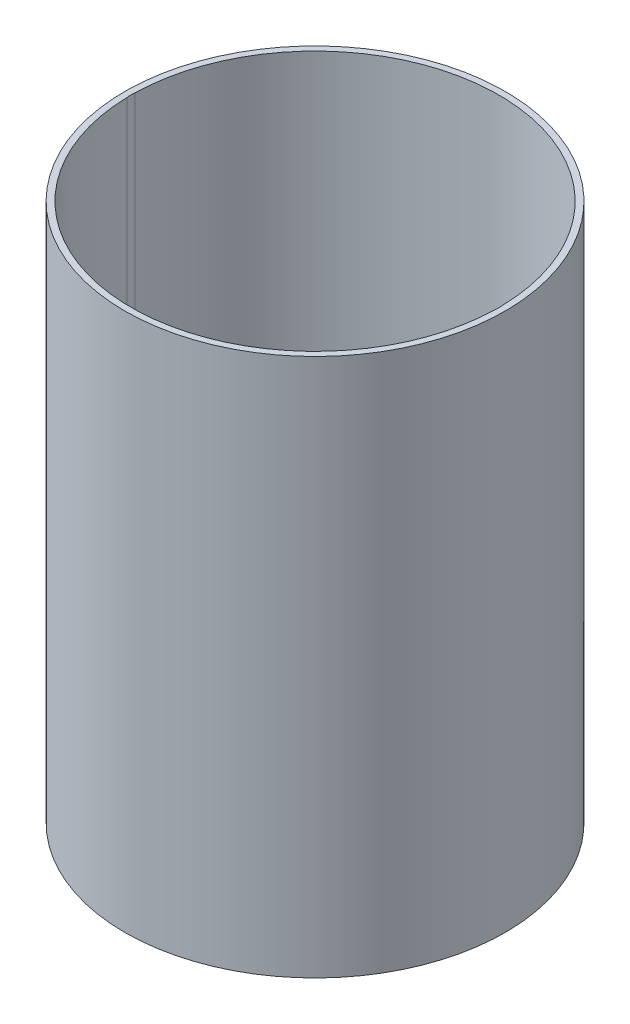
ISO-10303-21;
HEADER;
FILE_DESCRIPTION(('STEP AP214'),'2;1');
FILE_NAME('part.step','',(''),(''),'','','');
FILE_SCHEMA(('AUTOMOTIVE_DESIGN { 1 0 10303 214 1 1 1 1 }'));
ENDSEC;
DATA;
#1=APPLICATION_CONTEXT('core data for automotive mechanical design processes');
#2=APPLICATION_PROTOCOL_DEFINITION('international standard','automotive_design',2000,#1);
#3=PRODUCT_CONTEXT('',#1,'mechanical');
#4=PRODUCT('Part','Part','',(#3));
#5=PRODUCT_RELATED_PRODUCT_CATEGORY('part','',(#4));
#6=PRODUCT_DEFINITION_FORMATION('','',#4);
#7=PRODUCT_DEFINITION_CONTEXT('part definition',#1,'design');
#8=PRODUCT_DEFINITION('design','',#6,#7);
#9=PRODUCT_DEFINITION_SHAPE('','',#8);
#10=(LENGTH_UNIT() NAMED_UNIT(*) SI_UNIT(.MILLI.,.METRE.));
#11=(NAMED_UNIT(*) PLANE_ANGLE_UNIT() SI_UNIT($,.RADIAN.));
#12=(NAMED_UNIT(*) SI_UNIT($,.STERADIAN.) SOLID_ANGLE_UNIT());
#13=UNCERTAINTY_MEASURE_WITH_UNIT(LENGTH_MEASURE(1.E-05),#10,'distance_accuracy_value','');
#14=(GEOMETRIC_REPRESENTATION_CONTEXT(3) GLOBAL_UNCERTAINTY_ASSIGNED_CONTEXT((#13)) GLOBAL_UNIT_ASSIGNED_CONTEXT((#10,
#11,#12)) REPRESENTATION_CONTEXT('',''));
#15=CARTESIAN_POINT('',(0.,0.,0.));
#16=DIRECTION('',(0.,0.,1.));
#17=DIRECTION('',(1.,0.,0.));
#18=AXIS2_PLACEMENT_3D('',#15,#16,#17);
#19=CARTESIAN_POINT('',(0.,262.382,0.));
#20=DIRECTION('',(0.,-1.,0.));
#21=DIRECTION('',(0.,0.,-1.));
#22=AXIS2_PLACEMENT_3D('',#19,#20,#21);
#23=CYLINDRICAL_SURFACE('',#22,89.662);
#24=DIRECTION('',(0.,-1.,0.));
#25=VECTOR('',#24,1.);
#26=CARTESIAN_POINT('',(-89.6399543189369,131.191,-1.98817345795332));
#27=LINE('',#26,#25);
#28=CARTESIAN_POINT('',(-89.6399543189369,3.30200000000003,-1.98817345795332));
#29=VERTEX_POINT('',#28);
#30=CARTESIAN_POINT('',(-89.6399543189369,262.382,-1.98817345795317));
#31=VERTEX_POINT('',#30);
#32=EDGE_CURVE('E11',#29,#31,#27,.F.);
#33=ORIENTED_EDGE('',*,*,#32,.F.);
#34=CARTESIAN_POINT('',(0.,3.30200000000003,0.));
#35=DIRECTION('',(0.,1.,0.));
#36=DIRECTION('',(0.,0.,1.));
#37=AXIS2_PLACEMENT_3D('',#34,#35,#36);
#38=CIRCLE('',#37,89.662);
#39=CARTESIAN_POINT('',(89.6399543189369,3.30200000000003,-1.98817345795332));
#40=VERTEX_POINT('',#39);
#41=EDGE_CURVE('E117',#29,#40,#38,.F.);
#42=ORIENTED_EDGE('',*,*,#41,.T.);
#43=DIRECTION('',(0.,-1.,0.));
#44=VECTOR('',#43,1.);
#45=CARTESIAN_POINT('',(89.6399543189369,131.191,-1.98817345795332));
#46=LINE('',#45,#44);
#47=CARTESIAN_POINT('',(89.6399543189369,262.382,-1.98817345795317));
#48=VERTEX_POINT('',#47);
#49=EDGE_CURVE('E84',#48,#40,#46,.T.);
#50=ORIENTED_EDGE('',*,*,#49,.F.);
#51=CARTESIAN_POINT('',(0.,262.382,0.));
#52=DIRECTION('',(0.,1.,0.));
#53=DIRECTION('',(0.,0.,1.));
#54=AXIS2_PLACEMENT_3D('',#51,#52,#53);
#55=CIRCLE('',#54,89.662);
#56=EDGE_CURVE('E93',#48,#31,#55,.T.);
#57=ORIENTED_EDGE('',*,*,#56,.T.);
#58=EDGE_LOOP('',(#33,#42,#50,#57));
#59=FACE_BOUND('',#58,.T.);
#60=ADVANCED_FACE('F37',(#59),#23,.F.);
#61=CARTESIAN_POINT('',(0.,3.302,0.));
#62=DIRECTION('',(0.,1.,0.));
#63=DIRECTION('',(0.,0.,1.));
#64=AXIS2_PLACEMENT_3D('',#61,#62,#63);
#65=PLANE('',#64);
#66=CARTESIAN_POINT('',(-26.112352144,3.30200000000003,57.3248386784275));
#67=DIRECTION('',(0.,1.,0.));
#68=DIRECTION('',(0.,0.,1.));
#69=AXIS2_PLACEMENT_3D('',#66,#67,#68);
#70=CIRCLE('',#69,5.08);
#71=CARTESIAN_POINT('',(-26.112352144,3.30200000000003,62.4048386784275));
#72=VERTEX_POINT('',#71);
#73=EDGE_CURVE('E159',#72,#72,#70,.T.);
#74=ORIENTED_EDGE('',*,*,#73,.F.);
#75=EDGE_LOOP('',(#74));
#76=FACE_BOUND('',#75,.T.);
#77=CARTESIAN_POINT('',(9.193647856,3.30200000000003,61.0334508536087));
#78=DIRECTION('',(0.,1.,0.));
#79=DIRECTION('',(0.,0.,1.));
#80=AXIS2_PLACEMENT_3D('',#77,#78,#79);
#81=CIRCLE('',#80,5.08);
#82=CARTESIAN_POINT('',(9.193647856,3.30200000000003,66.1134508536087));
#83=VERTEX_POINT('',#82);
#84=EDGE_CURVE('E166',#83,#83,#81,.T.);
#85=ORIENTED_EDGE('',*,*,#84,.F.);
#86=EDGE_LOOP('',(#85));
#87=FACE_BOUND('',#86,.T.);
#88=CARTESIAN_POINT('',(38.1,3.30200000000003,-65.9911357683742));
#89=DIRECTION('',(0.,1.,0.));
#90=DIRECTION('',(0.,0.,1.));
#91=AXIS2_PLACEMENT_3D('',#88,#89,#90);
#92=CIRCLE('',#91,3.81);
#93=CARTESIAN_POINT('',(38.1,3.30200000000003,-62.1811357683742));
#94=VERTEX_POINT('',#93);
#95=EDGE_CURVE('E132',#94,#94,#92,.T.);
#96=ORIENTED_EDGE('',*,*,#95,.F.);
#97=EDGE_LOOP('',(#96));
#98=FACE_BOUND('',#97,.T.);
#99=CARTESIAN_POINT('',(-38.1,3.30200000000003,-65.9911357683742));
#100=DIRECTION('',(0.,1.,0.));
#101=DIRECTION('',(0.,0.,1.));
#102=AXIS2_PLACEMENT_3D('',#99,#100,#101);
#103=CIRCLE('',#102,3.81);
#104=CARTESIAN_POINT('',(-38.1,3.30200000000003,-62.1811357683742));
#105=VERTEX_POINT('',#104);
#106=EDGE_CURVE('E138',#105,#105,#103,.T.);
#107=ORIENTED_EDGE('',*,*,#106,.F.);
#108=EDGE_LOOP('',(#107));
#109=FACE_BOUND('',#108,.T.);
#110=CARTESIAN_POINT('',(-38.1,3.30200000000003,65.9911357683742));
#111=DIRECTION('',(0.,1.,0.));
#112=DIRECTION('',(0.,0.,1.));
#113=AXIS2_PLACEMENT_3D('',#110,#111,#112);
#114=CIRCLE('',#113,3.81);
#115=CARTESIAN_POINT('',(-38.1,3.30200000000003,69.8011357683742));
#116=VERTEX_POINT('',#115);
#117=EDGE_CURVE('E142',#116,#116,#114,.T.);
#118=ORIENTED_EDGE('',*,*,#117,.F.);
#119=EDGE_LOOP('',(#118));
#120=FACE_BOUND('',#119,.T.);
#121=CARTESIAN_POINT('',(38.1,3.30200000000003,65.9911357683742));
#122=DIRECTION('',(0.,1.,0.));
#123=DIRECTION('',(0.,0.,1.));
#124=AXIS2_PLACEMENT_3D('',#121,#122,#123);
#125=CIRCLE('',#124,3.81);
#126=CARTESIAN_POINT('',(38.1,3.30200000000003,69.8011357683742));
#127=VERTEX_POINT('',#126);
#128=EDGE_CURVE('E146',#127,#127,#125,.T.);
#129=ORIENTED_EDGE('',*,*,#128,.F.);
#130=EDGE_LOOP('',(#129));
#131=FACE_BOUND('',#130,.T.);
#132=CARTESIAN_POINT('',(-76.454,3.30200000000003,0.));
#133=DIRECTION('',(0.,1.,0.));
#134=DIRECTION('',(0.,0.,1.));
#135=AXIS2_PLACEMENT_3D('',#132,#133,#134);
#136=CIRCLE('',#135,13.335);
#137=CARTESIAN_POINT('',(-89.6399543189369,3.30200000000003,1.98817345795327));
#138=VERTEX_POINT('',#137);
#139=EDGE_CURVE('E98',#138,#29,#136,.T.);
#140=ORIENTED_EDGE('',*,*,#139,.F.);
#141=CARTESIAN_POINT('',(89.6399543189369,3.30200000000003,1.9881734579533));
#142=VERTEX_POINT('',#141);
#143=EDGE_CURVE('E115',#142,#138,#38,.F.);
#144=ORIENTED_EDGE('',*,*,#143,.F.);
#145=CARTESIAN_POINT('',(76.454,3.30200000000003,0.));
#146=DIRECTION('',(0.,1.,0.));
#147=DIRECTION('',(0.,0.,1.));
#148=AXIS2_PLACEMENT_3D('',#145,#146,#147);
#149=CIRCLE('',#148,13.335);
#150=EDGE_CURVE('E79',#40,#142,#149,.T.);
#151=ORIENTED_EDGE('',*,*,#150,.F.);
#152=ORIENTED_EDGE('',*,*,#41,.F.);
#153=EDGE_LOOP('',(#140,#144,#151,#152));
#154=FACE_BOUND('',#153,.T.);
#155=CARTESIAN_POINT('',(0.,3.302,0.));
#156=DIRECTION('',(0.,1.,0.));
#157=DIRECTION('',(0.,0.,1.));
#158=AXIS2_PLACEMENT_3D('',#155,#156,#157);
#159=CIRCLE('',#158,53.975);
#160=CARTESIAN_POINT('',(0.,3.302,53.975));
#161=VERTEX_POINT('',#160);
#162=EDGE_CURVE('E107',#161,#161,#159,.T.);
#163=ORIENTED_EDGE('',*,*,#162,.F.);
#164=EDGE_LOOP('',(#163));
#165=FACE_BOUND('',#164,.T.);
#166=ADVANCED_FACE('F124',(#76,#87,#98,#109,#120,#131,#154,#165),#65,.T.);
#167=CARTESIAN_POINT('',(0.,0.,0.));
#168=DIRECTION('',(0.,1.,0.));
#169=DIRECTION('',(0.,0.,1.));
#170=AXIS2_PLACEMENT_3D('',#167,#168,#169);
#171=PLANE('',#170);
#172=CARTESIAN_POINT('',(-26.112352144,0.,57.3248386784275));
#173=DIRECTION('',(0.,-1.,0.));
#174=DIRECTION('',(0.,0.,-1.));
#175=AXIS2_PLACEMENT_3D('',#172,#173,#174);
#176=CIRCLE('',#175,5.08);
#177=CARTESIAN_POINT('',(-26.112352144,0.,52.2448386784275));
#178=VERTEX_POINT('',#177);
#179=EDGE_CURVE('E169',#178,#178,#176,.T.);
#180=ORIENTED_EDGE('',*,*,#179,.F.);
#181=EDGE_LOOP('',(#180));
#182=FACE_BOUND('',#181,.T.);
#183=CARTESIAN_POINT('',(9.193647856,0.,61.0334508536087));
#184=DIRECTION('',(0.,-1.,0.));
#185=DIRECTION('',(0.,0.,-1.));
#186=AXIS2_PLACEMENT_3D('',#183,#184,#185);
#187=CIRCLE('',#186,5.08);
#188=CARTESIAN_POINT('',(9.193647856,0.,55.9534508536087));
#189=VERTEX_POINT('',#188);
#190=EDGE_CURVE('E170',#189,#189,#187,.T.);
#191=ORIENTED_EDGE('',*,*,#190,.F.);
#192=EDGE_LOOP('',(#191));
#193=FACE_BOUND('',#192,.T.);
#194=CARTESIAN_POINT('',(38.1,0.,-65.9911357683742));
#195=DIRECTION('',(0.,-1.,0.));
#196=DIRECTION('',(0.,0.,-1.));
#197=AXIS2_PLACEMENT_3D('',#194,#195,#196);
#198=CIRCLE('',#197,3.81);
#199=CARTESIAN_POINT('',(38.1,0.,-69.8011357683742));
#200=VERTEX_POINT('',#199);
#201=EDGE_CURVE('E155',#200,#200,#198,.T.);
#202=ORIENTED_EDGE('',*,*,#201,.F.);
#203=EDGE_LOOP('',(#202));
#204=FACE_BOUND('',#203,.T.);
#205=CARTESIAN_POINT('',(-38.1,0.,-65.9911357683742));
#206=DIRECTION('',(0.,-1.,0.));
#207=DIRECTION('',(0.,0.,-1.));
#208=AXIS2_PLACEMENT_3D('',#205,#206,#207);
#209=CIRCLE('',#208,3.81);
#210=CARTESIAN_POINT('',(-38.1,0.,-69.8011357683742));
#211=VERTEX_POINT('',#210);
#212=EDGE_CURVE('E158',#211,#211,#209,.T.);
#213=ORIENTED_EDGE('',*,*,#212,.F.);
#214=EDGE_LOOP('',(#213));
#215=FACE_BOUND('',#214,.T.);
#216=CARTESIAN_POINT('',(-38.1,0.,65.9911357683742));
#217=DIRECTION('',(0.,-1.,0.));
#218=DIRECTION('',(0.,0.,-1.));
#219=AXIS2_PLACEMENT_3D('',#216,#217,#218);
#220=CIRCLE('',#219,3.81);
#221=CARTESIAN_POINT('',(-38.1,0.,62.1811357683742));
#222=VERTEX_POINT('',#221);
#223=EDGE_CURVE('E154',#222,#222,#220,.T.);
#224=ORIENTED_EDGE('',*,*,#223,.F.);
#225=EDGE_LOOP('',(#224));
#226=FACE_BOUND('',#225,.T.);
#227=CARTESIAN_POINT('',(38.1,0.,65.9911357683742));
#228=DIRECTION('',(0.,-1.,0.));
#229=DIRECTION('',(0.,0.,-1.));
#230=AXIS2_PLACEMENT_3D('',#227,#228,#229);
#231=CIRCLE('',#230,3.81);
#232=CARTESIAN_POINT('',(38.1,0.,62.1811357683742));
#233=VERTEX_POINT('',#232);
#234=EDGE_CURVE('E151',#233,#233,#231,.T.);
#235=ORIENTED_EDGE('',*,*,#234,.F.);
#236=EDGE_LOOP('',(#235));
#237=FACE_BOUND('',#236,.T.);
#238=CARTESIAN_POINT('',(-76.454,0.,0.));
#239=DIRECTION('',(0.,-1.,0.));
#240=DIRECTION('',(0.,0.,-1.));
#241=AXIS2_PLACEMENT_3D('',#238,#239,#240);
#242=CIRCLE('',#241,13.335);
#243=CARTESIAN_POINT('',(-76.454,0.,-13.335));
#244=VERTEX_POINT('',#243);
#245=EDGE_CURVE('E94',#244,#244,#242,.T.);
#246=ORIENTED_EDGE('',*,*,#245,.F.);
#247=EDGE_LOOP('',(#246));
#248=FACE_BOUND('',#247,.T.);
#249=CARTESIAN_POINT('',(76.454,0.,0.));
#250=DIRECTION('',(0.,-1.,0.));
#251=DIRECTION('',(0.,0.,1.));
#252=AXIS2_PLACEMENT_3D('',#249,#250,#251);
#253=CIRCLE('',#252,13.335);
#254=CARTESIAN_POINT('',(76.454,0.,13.335));
#255=VERTEX_POINT('',#254);
#256=EDGE_CURVE('E95',#255,#255,#253,.T.);
#257=ORIENTED_EDGE('',*,*,#256,.F.);
#258=EDGE_LOOP('',(#257));
#259=FACE_BOUND('',#258,.T.);
#260=CARTESIAN_POINT('',(0.,0.,0.));
#261=DIRECTION('',(0.,1.,0.));
#262=DIRECTION('',(0.,0.,1.));
#263=AXIS2_PLACEMENT_3D('',#260,#261,#262);
#264=CIRCLE('',#263,92.71);
#265=CARTESIAN_POINT('',(0.,0.,92.71));
#266=VERTEX_POINT('',#265);
#267=EDGE_CURVE('E110',#266,#266,#264,.T.);
#268=ORIENTED_EDGE('',*,*,#267,.F.);
#269=EDGE_LOOP('',(#268));
#270=FACE_BOUND('',#269,.T.);
#271=CARTESIAN_POINT('',(0.,0.,0.));
#272=DIRECTION('',(0.,1.,0.));
#273=DIRECTION('',(0.,0.,1.));
#274=AXIS2_PLACEMENT_3D('',#271,#272,#273);
#275=CIRCLE('',#274,53.975);
#276=CARTESIAN_POINT('',(0.,0.,53.975));
#277=VERTEX_POINT('',#276);
#278=EDGE_CURVE('E106',#277,#277,#275,.T.);
#279=ORIENTED_EDGE('',*,*,#278,.T.);
#280=EDGE_LOOP('',(#279));
#281=FACE_BOUND('',#280,.T.);
#282=ADVANCED_FACE('F178',(#182,#193,#204,#215,#226,#237,#248,#259,#270,#281),#171,.F.);
#283=CARTESIAN_POINT('',(0.,3.302,0.));
#284=DIRECTION('',(0.,-1.,0.));
#285=DIRECTION('',(0.,0.,-1.));
#286=AXIS2_PLACEMENT_3D('',#283,#284,#285);
#287=CYLINDRICAL_SURFACE('',#286,92.71);
#288=ORIENTED_EDGE('',*,*,#267,.T.);
#289=EDGE_LOOP('',(#288));
#290=FACE_BOUND('',#289,.T.);
#291=CARTESIAN_POINT('',(0.,262.382,0.));
#292=DIRECTION('',(0.,1.,0.));
#293=DIRECTION('',(0.,0.,1.));
#294=AXIS2_PLACEMENT_3D('',#291,#292,#293);
#295=CIRCLE('',#294,92.71);
#296=CARTESIAN_POINT('',(0.,262.382,92.71));
#297=VERTEX_POINT('',#296);
#298=EDGE_CURVE('E100',#297,#297,#295,.T.);
#299=ORIENTED_EDGE('',*,*,#298,.F.);
#300=EDGE_LOOP('',(#299));
#301=FACE_BOUND('',#300,.T.);
#302=ADVANCED_FACE('F39',(#290,#301),#287,.T.);
#303=CARTESIAN_POINT('',(0.,3.302,0.));
#304=DIRECTION('',(0.,-1.,0.));
#305=DIRECTION('',(0.,0.,-1.));
#306=AXIS2_PLACEMENT_3D('',#303,#304,#305);
#307=CYLINDRICAL_SURFACE('',#306,53.975);
#308=ORIENTED_EDGE('',*,*,#162,.T.);
#309=EDGE_LOOP('',(#308));
#310=FACE_BOUND('',#309,.T.);
#311=ORIENTED_EDGE('',*,*,#278,.F.);
#312=EDGE_LOOP('',(#311));
#313=FACE_BOUND('',#312,.T.);
#314=ADVANCED_FACE('F198',(#310,#313),#307,.F.);
#315=CARTESIAN_POINT('',(0.,262.382,0.));
#316=DIRECTION('',(0.,1.,0.));
#317=DIRECTION('',(0.,0.,1.));
#318=AXIS2_PLACEMENT_3D('',#315,#316,#317);
#319=PLANE('',#318);
#320=CARTESIAN_POINT('',(-76.454,262.382,0.));
#321=DIRECTION('',(0.,-1.,0.));
#322=DIRECTION('',(0.,0.,-1.));
#323=AXIS2_PLACEMENT_3D('',#320,#321,#322);
#324=CIRCLE('',#323,13.335);
#325=CARTESIAN_POINT('',(-89.6399543189369,262.382,1.98817345795314));
#326=VERTEX_POINT('',#325);
#327=EDGE_CURVE('E51',#326,#31,#324,.T.);
#328=ORIENTED_EDGE('',*,*,#327,.T.);
#329=ORIENTED_EDGE('',*,*,#56,.F.);
#330=CARTESIAN_POINT('',(76.454,262.382,0.));
#331=DIRECTION('',(0.,-1.,0.));
#332=DIRECTION('',(0.,0.,1.));
#333=AXIS2_PLACEMENT_3D('',#330,#331,#332);
#334=CIRCLE('',#333,13.335);
#335=CARTESIAN_POINT('',(89.6399543189369,262.382,1.98817345795314));
#336=VERTEX_POINT('',#335);
#337=EDGE_CURVE('E59',#48,#336,#334,.T.);
#338=ORIENTED_EDGE('',*,*,#337,.T.);
#339=EDGE_CURVE('E91',#326,#336,#55,.T.);
#340=ORIENTED_EDGE('',*,*,#339,.F.);
#341=EDGE_LOOP('',(#328,#329,#338,#340));
#342=FACE_BOUND('',#341,.T.);
#343=ORIENTED_EDGE('',*,*,#298,.T.);
#344=EDGE_LOOP('',(#343));
#345=FACE_BOUND('',#344,.T.);
#346=ADVANCED_FACE('F89',(#342,#345),#319,.T.);
#347=DIRECTION('',(0.,-1.,0.));
#348=VECTOR('',#347,1.);
#349=CARTESIAN_POINT('',(-89.6399543189369,131.191,1.9881734579533));
#350=LINE('',#349,#348);
#351=EDGE_CURVE('E45',#326,#138,#350,.T.);
#352=ORIENTED_EDGE('',*,*,#351,.F.);
#353=ORIENTED_EDGE('',*,*,#339,.T.);
#354=DIRECTION('',(0.,-1.,0.));
#355=VECTOR('',#354,1.);
#356=CARTESIAN_POINT('',(89.6399543189369,131.191,1.9881734579533));
#357=LINE('',#356,#355);
#358=EDGE_CURVE('E75',#142,#336,#357,.F.);
#359=ORIENTED_EDGE('',*,*,#358,.F.);
#360=ORIENTED_EDGE('',*,*,#143,.T.);
#361=EDGE_LOOP('',(#352,#353,#359,#360));
#362=FACE_BOUND('',#361,.T.);
#363=ADVANCED_FACE('F97',(#362),#23,.F.);
#364=CARTESIAN_POINT('',(76.454,262.382,0.));
#365=DIRECTION('',(0.,-1.,0.));
#366=DIRECTION('',(0.,0.,-1.));
#367=AXIS2_PLACEMENT_3D('',#364,#365,#366);
#368=CYLINDRICAL_SURFACE('',#367,13.335);
#369=ORIENTED_EDGE('',*,*,#358,.T.);
#370=ORIENTED_EDGE('',*,*,#337,.F.);
#371=ORIENTED_EDGE('',*,*,#49,.T.);
#372=ORIENTED_EDGE('',*,*,#150,.T.);
#373=EDGE_LOOP('',(#369,#370,#371,#372));
#374=FACE_BOUND('',#373,.T.);
#375=ORIENTED_EDGE('',*,*,#256,.T.);
#376=EDGE_LOOP('',(#375));
#377=FACE_BOUND('',#376,.T.);
#378=ADVANCED_FACE('F76',(#374,#377),#368,.F.);
#379=CARTESIAN_POINT('',(-76.454,262.382,0.));
#380=DIRECTION('',(0.,-1.,0.));
#381=DIRECTION('',(0.,0.,-1.));
#382=AXIS2_PLACEMENT_3D('',#379,#380,#381);
#383=CYLINDRICAL_SURFACE('',#382,13.335);
#384=ORIENTED_EDGE('',*,*,#32,.T.);
#385=ORIENTED_EDGE('',*,*,#327,.F.);
#386=ORIENTED_EDGE('',*,*,#351,.T.);
#387=ORIENTED_EDGE('',*,*,#139,.T.);
#388=EDGE_LOOP('',(#384,#385,#386,#387));
#389=FACE_BOUND('',#388,.T.);
#390=ORIENTED_EDGE('',*,*,#245,.T.);
#391=EDGE_LOOP('',(#390));
#392=FACE_BOUND('',#391,.T.);
#393=ADVANCED_FACE('F119',(#389,#392),#383,.F.);
#394=CARTESIAN_POINT('',(38.1,262.382,65.9911357683742));
#395=DIRECTION('',(0.,-1.,0.));
#396=DIRECTION('',(0.,0.,-1.));
#397=AXIS2_PLACEMENT_3D('',#394,#395,#396);
#398=CYLINDRICAL_SURFACE('',#397,3.81);
#399=ORIENTED_EDGE('',*,*,#128,.T.);
#400=EDGE_LOOP('',(#399));
#401=FACE_BOUND('',#400,.T.);
#402=ORIENTED_EDGE('',*,*,#234,.T.);
#403=EDGE_LOOP('',(#402));
#404=FACE_BOUND('',#403,.T.);
#405=ADVANCED_FACE('F223',(#401,#404),#398,.F.);
#406=CARTESIAN_POINT('',(-38.1,262.382,65.9911357683742));
#407=DIRECTION('',(0.,-1.,0.));
#408=DIRECTION('',(0.,0.,-1.));
#409=AXIS2_PLACEMENT_3D('',#406,#407,#408);
#410=CYLINDRICAL_SURFACE('',#409,3.81);
#411=ORIENTED_EDGE('',*,*,#117,.T.);
#412=EDGE_LOOP('',(#411));
#413=FACE_BOUND('',#412,.T.);
#414=ORIENTED_EDGE('',*,*,#223,.T.);
#415=EDGE_LOOP('',(#414));
#416=FACE_BOUND('',#415,.T.);
#417=ADVANCED_FACE('F228',(#413,#416),#410,.F.);
#418=CARTESIAN_POINT('',(-38.1,262.382,-65.9911357683742));
#419=DIRECTION('',(0.,-1.,0.));
#420=DIRECTION('',(0.,0.,-1.));
#421=AXIS2_PLACEMENT_3D('',#418,#419,#420);
#422=CYLINDRICAL_SURFACE('',#421,3.81);
#423=ORIENTED_EDGE('',*,*,#106,.T.);
#424=EDGE_LOOP('',(#423));
#425=FACE_BOUND('',#424,.T.);
#426=ORIENTED_EDGE('',*,*,#212,.T.);
#427=EDGE_LOOP('',(#426));
#428=FACE_BOUND('',#427,.T.);
#429=ADVANCED_FACE('F234',(#425,#428),#422,.F.);
#430=CARTESIAN_POINT('',(38.1,262.382,-65.9911357683742));
#431=DIRECTION('',(0.,-1.,0.));
#432=DIRECTION('',(0.,0.,-1.));
#433=AXIS2_PLACEMENT_3D('',#430,#431,#432);
#434=CYLINDRICAL_SURFACE('',#433,3.81);
#435=ORIENTED_EDGE('',*,*,#95,.T.);
#436=EDGE_LOOP('',(#435));
#437=FACE_BOUND('',#436,.T.);
#438=ORIENTED_EDGE('',*,*,#201,.T.);
#439=EDGE_LOOP('',(#438));
#440=FACE_BOUND('',#439,.T.);
#441=ADVANCED_FACE('F230',(#437,#440),#434,.F.);
#442=CARTESIAN_POINT('',(9.193647856,262.382,61.0334508536087));
#443=DIRECTION('',(0.,-1.,0.));
#444=DIRECTION('',(0.,0.,-1.));
#445=AXIS2_PLACEMENT_3D('',#442,#443,#444);
#446=CYLINDRICAL_SURFACE('',#445,5.08);
#447=ORIENTED_EDGE('',*,*,#84,.T.);
#448=EDGE_LOOP('',(#447));
#449=FACE_BOUND('',#448,.T.);
#450=ORIENTED_EDGE('',*,*,#190,.T.);
#451=EDGE_LOOP('',(#450));
#452=FACE_BOUND('',#451,.T.);
#453=ADVANCED_FACE('F233',(#449,#452),#446,.F.);
#454=CARTESIAN_POINT('',(-26.112352144,262.382,57.3248386784275));
#455=DIRECTION('',(0.,-1.,0.));
#456=DIRECTION('',(0.,0.,-1.));
#457=AXIS2_PLACEMENT_3D('',#454,#455,#456);
#458=CYLINDRICAL_SURFACE('',#457,5.08);
#459=ORIENTED_EDGE('',*,*,#73,.T.);
#460=EDGE_LOOP('',(#459));
#461=FACE_BOUND('',#460,.T.);
#462=ORIENTED_EDGE('',*,*,#179,.T.);
#463=EDGE_LOOP('',(#462));
#464=FACE_BOUND('',#463,.T.);
#465=ADVANCED_FACE('F176',(#461,#464),#458,.F.);
#466=CLOSED_SHELL('',(#60,#166,#282,#302,#314,#346,#363,#378,#393,#405,#417,#429,#441,#453,#465));
#467=MANIFOLD_SOLID_BREP('B2',#466);
#468=ADVANCED_BREP_SHAPE_REPRESENTATION('',(#18,#467),#14);
#469=SHAPE_DEFINITION_REPRESENTATION(#9,#468);
ENDSEC;
END-ISO-10303-21;
